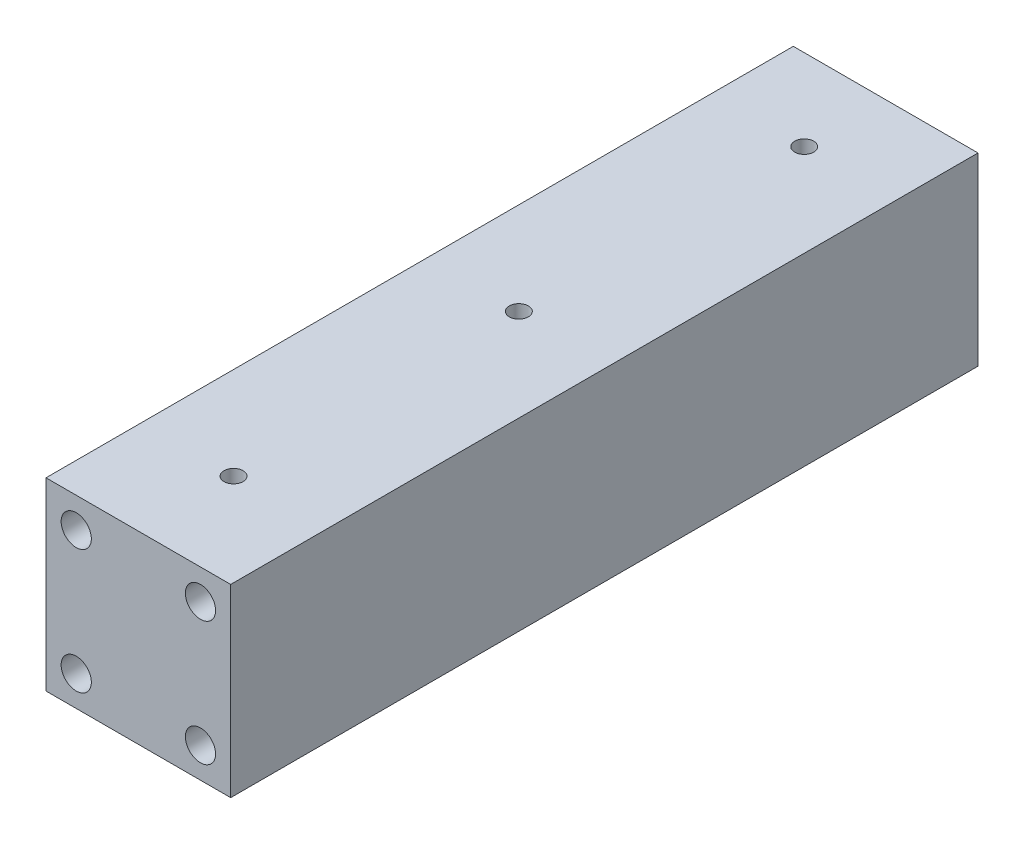
ISO-10303-21;
HEADER;
FILE_DESCRIPTION(('STEP AP214'),'2;1');
FILE_NAME('part.step','',(''),(''),'','','');
FILE_SCHEMA(('AUTOMOTIVE_DESIGN { 1 0 10303 214 1 1 1 1 }'));
ENDSEC;
DATA;
#1=APPLICATION_CONTEXT('core data for automotive mechanical design processes');
#2=APPLICATION_PROTOCOL_DEFINITION('international standard','automotive_design',2000,#1);
#3=PRODUCT_CONTEXT('',#1,'mechanical');
#4=PRODUCT('Part','Part','',(#3));
#5=PRODUCT_RELATED_PRODUCT_CATEGORY('part','',(#4));
#6=PRODUCT_DEFINITION_FORMATION('','',#4);
#7=PRODUCT_DEFINITION_CONTEXT('part definition',#1,'design');
#8=PRODUCT_DEFINITION('design','',#6,#7);
#9=PRODUCT_DEFINITION_SHAPE('','',#8);
#10=(LENGTH_UNIT() NAMED_UNIT(*) SI_UNIT(.MILLI.,.METRE.));
#11=(NAMED_UNIT(*) PLANE_ANGLE_UNIT() SI_UNIT($,.RADIAN.));
#12=(NAMED_UNIT(*) SI_UNIT($,.STERADIAN.) SOLID_ANGLE_UNIT());
#13=UNCERTAINTY_MEASURE_WITH_UNIT(LENGTH_MEASURE(1.E-05),#10,'distance_accuracy_value','');
#14=(GEOMETRIC_REPRESENTATION_CONTEXT(3) GLOBAL_UNCERTAINTY_ASSIGNED_CONTEXT((#13)) GLOBAL_UNIT_ASSIGNED_CONTEXT((#10,
#11,#12)) REPRESENTATION_CONTEXT('',''));
#15=CARTESIAN_POINT('',(0.,0.,0.));
#16=DIRECTION('',(0.,0.,1.));
#17=DIRECTION('',(1.,0.,0.));
#18=AXIS2_PLACEMENT_3D('',#15,#16,#17);
#19=CARTESIAN_POINT('',(0.,38.80104,0.));
#20=DIRECTION('',(0.,0.,-1.));
#21=DIRECTION('',(-1.,0.,0.));
#22=AXIS2_PLACEMENT_3D('',#19,#20,#21);
#23=PLANE('',#22);
#24=CARTESIAN_POINT('',(-6.55051999999914,6.35000000000094,0.));
#25=DIRECTION('',(0.,0.,1.));
#26=DIRECTION('',(1.,0.,0.));
#27=AXIS2_PLACEMENT_3D('',#24,#25,#26);
#28=CIRCLE('',#27,3.17499999999884);
#29=CARTESIAN_POINT('',(-3.37552000000031,6.35000000000094,0.));
#30=VERTEX_POINT('',#29);
#31=EDGE_CURVE('E137',#30,#30,#28,.T.);
#32=ORIENTED_EDGE('',*,*,#31,.F.);
#33=EDGE_LOOP('',(#32));
#34=FACE_BOUND('',#33,.T.);
#35=CARTESIAN_POINT('',(19.5505199999996,6.35000000000095,0.));
#36=DIRECTION('',(0.,0.,1.));
#37=DIRECTION('',(1.,0.,0.));
#38=AXIS2_PLACEMENT_3D('',#35,#36,#37);
#39=CIRCLE('',#38,3.17500000000024);
#40=CARTESIAN_POINT('',(22.7255199999999,6.35000000000095,0.));
#41=VERTEX_POINT('',#40);
#42=EDGE_CURVE('E141',#41,#41,#39,.T.);
#43=ORIENTED_EDGE('',*,*,#42,.F.);
#44=EDGE_LOOP('',(#43));
#45=FACE_BOUND('',#44,.T.);
#46=CARTESIAN_POINT('',(19.5505199999996,32.4510400000001,0.));
#47=DIRECTION('',(0.,0.,1.));
#48=DIRECTION('',(1.,0.,0.));
#49=AXIS2_PLACEMENT_3D('',#46,#47,#48);
#50=CIRCLE('',#49,3.17500000000054);
#51=CARTESIAN_POINT('',(22.7255200000002,32.4510400000001,0.));
#52=VERTEX_POINT('',#51);
#53=EDGE_CURVE('E145',#52,#52,#50,.T.);
#54=ORIENTED_EDGE('',*,*,#53,.F.);
#55=EDGE_LOOP('',(#54));
#56=FACE_BOUND('',#55,.T.);
#57=CARTESIAN_POINT('',(-6.55051999999998,32.4510400000001,0.));
#58=DIRECTION('',(0.,0.,1.));
#59=DIRECTION('',(1.,0.,0.));
#60=AXIS2_PLACEMENT_3D('',#57,#58,#59);
#61=CIRCLE('',#60,3.175);
#62=CARTESIAN_POINT('',(-3.37551999999998,32.4510400000001,0.));
#63=VERTEX_POINT('',#62);
#64=EDGE_CURVE('E148',#63,#63,#61,.T.);
#65=ORIENTED_EDGE('',*,*,#64,.F.);
#66=EDGE_LOOP('',(#65));
#67=FACE_BOUND('',#66,.T.);
#68=DIRECTION('',(1.,0.,0.));
#69=VECTOR('',#68,1.);
#70=CARTESIAN_POINT('',(0.,0.,0.));
#71=LINE('',#70,#69);
#72=CARTESIAN_POINT('',(-12.90052,0.,0.));
#73=VERTEX_POINT('',#72);
#74=CARTESIAN_POINT('',(25.9005200000001,0.,0.));
#75=VERTEX_POINT('',#74);
#76=EDGE_CURVE('E102',#73,#75,#71,.T.);
#77=ORIENTED_EDGE('',*,*,#76,.T.);
#78=DIRECTION('',(0.,-1.,0.));
#79=VECTOR('',#78,1.);
#80=CARTESIAN_POINT('',(25.9005200000001,38.80104,0.));
#81=LINE('',#80,#79);
#82=CARTESIAN_POINT('',(25.9005200000001,38.80104,0.));
#83=VERTEX_POINT('',#82);
#84=EDGE_CURVE('E11',#83,#75,#81,.T.);
#85=ORIENTED_EDGE('',*,*,#84,.F.);
#86=DIRECTION('',(1.,0.,0.));
#87=VECTOR('',#86,1.);
#88=CARTESIAN_POINT('',(0.,38.80104,0.));
#89=LINE('',#88,#87);
#90=CARTESIAN_POINT('',(-12.90052,38.80104,0.));
#91=VERTEX_POINT('',#90);
#92=EDGE_CURVE('E87',#91,#83,#89,.T.);
#93=ORIENTED_EDGE('',*,*,#92,.F.);
#94=DIRECTION('',(0.,-1.,0.));
#95=VECTOR('',#94,1.);
#96=CARTESIAN_POINT('',(-12.90052,38.80104,0.));
#97=LINE('',#96,#95);
#98=EDGE_CURVE('E98',#91,#73,#97,.T.);
#99=ORIENTED_EDGE('',*,*,#98,.T.);
#100=EDGE_LOOP('',(#77,#85,#93,#99));
#101=FACE_BOUND('',#100,.T.);
#102=ADVANCED_FACE('F40',(#34,#45,#56,#67,#101),#23,.F.);
#103=CARTESIAN_POINT('',(25.9005200000001,38.80104,0.));
#104=DIRECTION('',(-1.,0.,0.));
#105=DIRECTION('',(0.,0.,1.));
#106=AXIS2_PLACEMENT_3D('',#103,#104,#105);
#107=PLANE('',#106);
#108=DIRECTION('',(0.,0.,-1.));
#109=VECTOR('',#108,1.);
#110=CARTESIAN_POINT('',(25.9005200000001,0.,0.));
#111=LINE('',#110,#109);
#112=CARTESIAN_POINT('',(25.90052,0.,-156.99994));
#113=VERTEX_POINT('',#112);
#114=EDGE_CURVE('E92',#75,#113,#111,.T.);
#115=ORIENTED_EDGE('',*,*,#114,.T.);
#116=DIRECTION('',(0.,-1.,0.));
#117=VECTOR('',#116,1.);
#118=CARTESIAN_POINT('',(25.90052,38.80104,-156.99994));
#119=LINE('',#118,#117);
#120=CARTESIAN_POINT('',(25.90052,38.80104,-156.99994));
#121=VERTEX_POINT('',#120);
#122=EDGE_CURVE('E48',#121,#113,#119,.T.);
#123=ORIENTED_EDGE('',*,*,#122,.F.);
#124=DIRECTION('',(0.,0.,-1.));
#125=VECTOR('',#124,1.);
#126=CARTESIAN_POINT('',(25.9005200000001,38.80104,0.));
#127=LINE('',#126,#125);
#128=EDGE_CURVE('E82',#83,#121,#127,.T.);
#129=ORIENTED_EDGE('',*,*,#128,.F.);
#130=ORIENTED_EDGE('',*,*,#84,.T.);
#131=EDGE_LOOP('',(#115,#123,#129,#130));
#132=FACE_BOUND('',#131,.T.);
#133=ADVANCED_FACE('F91',(#132),#107,.F.);
#134=CARTESIAN_POINT('',(-1.12306879050644E-13,38.80104,-156.99994));
#135=DIRECTION('',(0.,0.,-1.));
#136=DIRECTION('',(-1.,0.,0.));
#137=AXIS2_PLACEMENT_3D('',#134,#135,#136);
#138=PLANE('',#137);
#139=CARTESIAN_POINT('',(-6.55051999999914,6.35000000000094,-156.99994));
#140=DIRECTION('',(0.,0.,-1.));
#141=DIRECTION('',(-1.,0.,0.));
#142=AXIS2_PLACEMENT_3D('',#139,#140,#141);
#143=CIRCLE('',#142,3.17499999999884);
#144=CARTESIAN_POINT('',(-9.72551999999798,6.35000000000094,-156.99994));
#145=VERTEX_POINT('',#144);
#146=EDGE_CURVE('E287',#145,#145,#143,.T.);
#147=ORIENTED_EDGE('',*,*,#146,.F.);
#148=EDGE_LOOP('',(#147));
#149=FACE_BOUND('',#148,.T.);
#150=CARTESIAN_POINT('',(19.5505199999996,6.35000000000095,-156.99994));
#151=DIRECTION('',(0.,0.,-1.));
#152=DIRECTION('',(-1.,0.,0.));
#153=AXIS2_PLACEMENT_3D('',#150,#151,#152);
#154=CIRCLE('',#153,3.17500000000024);
#155=CARTESIAN_POINT('',(16.3755199999994,6.35000000000095,-156.99994));
#156=VERTEX_POINT('',#155);
#157=EDGE_CURVE('E281',#156,#156,#154,.T.);
#158=ORIENTED_EDGE('',*,*,#157,.F.);
#159=EDGE_LOOP('',(#158));
#160=FACE_BOUND('',#159,.T.);
#161=CARTESIAN_POINT('',(19.5505199999996,32.4510400000001,-156.99994));
#162=DIRECTION('',(0.,0.,-1.));
#163=DIRECTION('',(-1.,0.,0.));
#164=AXIS2_PLACEMENT_3D('',#161,#162,#163);
#165=CIRCLE('',#164,3.17500000000054);
#166=CARTESIAN_POINT('',(16.3755199999991,32.4510400000001,-156.99994));
#167=VERTEX_POINT('',#166);
#168=EDGE_CURVE('E270',#167,#167,#165,.T.);
#169=ORIENTED_EDGE('',*,*,#168,.F.);
#170=EDGE_LOOP('',(#169));
#171=FACE_BOUND('',#170,.T.);
#172=CARTESIAN_POINT('',(-6.55051999999998,32.4510400000001,-156.99994));
#173=DIRECTION('',(0.,0.,-1.));
#174=DIRECTION('',(-1.,0.,0.));
#175=AXIS2_PLACEMENT_3D('',#172,#173,#174);
#176=CIRCLE('',#175,3.175);
#177=CARTESIAN_POINT('',(-9.72551999999997,32.4510400000001,-156.99994));
#178=VERTEX_POINT('',#177);
#179=EDGE_CURVE('E269',#178,#178,#176,.T.);
#180=ORIENTED_EDGE('',*,*,#179,.F.);
#181=EDGE_LOOP('',(#180));
#182=FACE_BOUND('',#181,.T.);
#183=DIRECTION('',(1.,0.,0.));
#184=VECTOR('',#183,1.);
#185=CARTESIAN_POINT('',(-1.12306879050644E-13,0.,-156.99994));
#186=LINE('',#185,#184);
#187=CARTESIAN_POINT('',(-12.90052,0.,-156.99994));
#188=VERTEX_POINT('',#187);
#189=EDGE_CURVE('E107',#188,#113,#186,.T.);
#190=ORIENTED_EDGE('',*,*,#189,.F.);
#191=DIRECTION('',(0.,-1.,0.));
#192=VECTOR('',#191,1.);
#193=CARTESIAN_POINT('',(-12.90052,38.80104,-156.99994));
#194=LINE('',#193,#192);
#195=CARTESIAN_POINT('',(-12.90052,38.80104,-156.99994));
#196=VERTEX_POINT('',#195);
#197=EDGE_CURVE('E72',#196,#188,#194,.T.);
#198=ORIENTED_EDGE('',*,*,#197,.F.);
#199=DIRECTION('',(1.,0.,0.));
#200=VECTOR('',#199,1.);
#201=CARTESIAN_POINT('',(-1.12306879050644E-13,38.80104,-156.99994));
#202=LINE('',#201,#200);
#203=EDGE_CURVE('E85',#196,#121,#202,.T.);
#204=ORIENTED_EDGE('',*,*,#203,.T.);
#205=ORIENTED_EDGE('',*,*,#122,.T.);
#206=EDGE_LOOP('',(#190,#198,#204,#205));
#207=FACE_BOUND('',#206,.T.);
#208=ADVANCED_FACE('F96',(#149,#160,#171,#182,#207),#138,.T.);
#209=CARTESIAN_POINT('',(-12.90052,38.80104,0.));
#210=DIRECTION('',(1.,0.,0.));
#211=DIRECTION('',(0.,0.,-1.));
#212=AXIS2_PLACEMENT_3D('',#209,#210,#211);
#213=PLANE('',#212);
#214=DIRECTION('',(0.,0.,1.));
#215=VECTOR('',#214,1.);
#216=CARTESIAN_POINT('',(-12.90052,0.,0.));
#217=LINE('',#216,#215);
#218=EDGE_CURVE('E75',#188,#73,#217,.T.);
#219=ORIENTED_EDGE('',*,*,#218,.T.);
#220=ORIENTED_EDGE('',*,*,#98,.F.);
#221=DIRECTION('',(0.,0.,1.));
#222=VECTOR('',#221,1.);
#223=CARTESIAN_POINT('',(-12.90052,38.80104,0.));
#224=LINE('',#223,#222);
#225=EDGE_CURVE('E56',#196,#91,#224,.T.);
#226=ORIENTED_EDGE('',*,*,#225,.F.);
#227=ORIENTED_EDGE('',*,*,#197,.T.);
#228=EDGE_LOOP('',(#219,#220,#226,#227));
#229=FACE_BOUND('',#228,.T.);
#230=ADVANCED_FACE('F125',(#229),#213,.F.);
#231=CARTESIAN_POINT('',(0.,38.80104,0.));
#232=DIRECTION('',(0.,1.,0.));
#233=DIRECTION('',(0.,0.,1.));
#234=AXIS2_PLACEMENT_3D('',#231,#232,#233);
#235=PLANE('',#234);
#236=CARTESIAN_POINT('',(6.5,38.80104,-20.));
#237=DIRECTION('',(0.,1.,0.));
#238=DIRECTION('',(0.,0.,1.));
#239=AXIS2_PLACEMENT_3D('',#236,#237,#238);
#240=CIRCLE('',#239,2.);
#241=CARTESIAN_POINT('',(6.5,38.80104,-18.));
#242=VERTEX_POINT('',#241);
#243=EDGE_CURVE('E162',#242,#242,#240,.T.);
#244=ORIENTED_EDGE('',*,*,#243,.F.);
#245=EDGE_LOOP('',(#244));
#246=FACE_BOUND('',#245,.T.);
#247=CARTESIAN_POINT('',(6.5,38.80104,-79.944));
#248=DIRECTION('',(0.,1.,0.));
#249=DIRECTION('',(0.,0.,1.));
#250=AXIS2_PLACEMENT_3D('',#247,#248,#249);
#251=CIRCLE('',#250,2.);
#252=CARTESIAN_POINT('',(6.5,38.80104,-77.944));
#253=VERTEX_POINT('',#252);
#254=EDGE_CURVE('E168',#253,#253,#251,.T.);
#255=ORIENTED_EDGE('',*,*,#254,.F.);
#256=EDGE_LOOP('',(#255));
#257=FACE_BOUND('',#256,.T.);
#258=CARTESIAN_POINT('',(6.5,38.80104,-139.888));
#259=DIRECTION('',(0.,1.,0.));
#260=DIRECTION('',(0.,0.,1.));
#261=AXIS2_PLACEMENT_3D('',#258,#259,#260);
#262=CIRCLE('',#261,2.);
#263=CARTESIAN_POINT('',(6.5,38.80104,-137.888));
#264=VERTEX_POINT('',#263);
#265=EDGE_CURVE('E154',#264,#264,#262,.T.);
#266=ORIENTED_EDGE('',*,*,#265,.F.);
#267=EDGE_LOOP('',(#266));
#268=FACE_BOUND('',#267,.T.);
#269=ORIENTED_EDGE('',*,*,#92,.T.);
#270=ORIENTED_EDGE('',*,*,#128,.T.);
#271=ORIENTED_EDGE('',*,*,#203,.F.);
#272=ORIENTED_EDGE('',*,*,#225,.T.);
#273=EDGE_LOOP('',(#269,#270,#271,#272));
#274=FACE_BOUND('',#273,.T.);
#275=ADVANCED_FACE('F83',(#246,#257,#268,#274),#235,.T.);
#276=CARTESIAN_POINT('',(0.,0.,0.));
#277=DIRECTION('',(0.,1.,0.));
#278=DIRECTION('',(0.,0.,1.));
#279=AXIS2_PLACEMENT_3D('',#276,#277,#278);
#280=PLANE('',#279);
#281=ORIENTED_EDGE('',*,*,#76,.F.);
#282=ORIENTED_EDGE('',*,*,#218,.F.);
#283=ORIENTED_EDGE('',*,*,#189,.T.);
#284=ORIENTED_EDGE('',*,*,#114,.F.);
#285=EDGE_LOOP('',(#281,#282,#283,#284));
#286=FACE_BOUND('',#285,.T.);
#287=ADVANCED_FACE('F114',(#286),#280,.F.);
#288=CARTESIAN_POINT('',(6.5,32.45104,-139.888));
#289=DIRECTION('',(0.,1.,0.));
#290=DIRECTION('',(0.,0.,1.));
#291=AXIS2_PLACEMENT_3D('',#288,#289,#290);
#292=CYLINDRICAL_SURFACE('',#291,2.);
#293=CARTESIAN_POINT('',(6.5,32.45104,-139.888));
#294=DIRECTION('',(0.,1.,0.));
#295=DIRECTION('',(0.,0.,1.));
#296=AXIS2_PLACEMENT_3D('',#293,#294,#295);
#297=CIRCLE('',#296,2.);
#298=CARTESIAN_POINT('',(6.5,32.45104,-137.888));
#299=VERTEX_POINT('',#298);
#300=EDGE_CURVE('E171',#299,#299,#297,.T.);
#301=ORIENTED_EDGE('',*,*,#300,.F.);
#302=EDGE_LOOP('',(#301));
#303=FACE_BOUND('',#302,.T.);
#304=ORIENTED_EDGE('',*,*,#265,.T.);
#305=EDGE_LOOP('',(#304));
#306=FACE_BOUND('',#305,.T.);
#307=ADVANCED_FACE('F116',(#303,#306),#292,.F.);
#308=CARTESIAN_POINT('',(6.5,32.45104,-139.888));
#309=DIRECTION('',(0.,1.,0.));
#310=DIRECTION('',(0.,0.,1.));
#311=AXIS2_PLACEMENT_3D('',#308,#309,#310);
#312=PLANE('',#311);
#313=ORIENTED_EDGE('',*,*,#300,.T.);
#314=EDGE_LOOP('',(#313));
#315=FACE_BOUND('',#314,.T.);
#316=ADVANCED_FACE('F122',(#315),#312,.T.);
#317=CARTESIAN_POINT('',(6.5,32.45104,-79.944));
#318=DIRECTION('',(0.,1.,0.));
#319=DIRECTION('',(0.,0.,1.));
#320=AXIS2_PLACEMENT_3D('',#317,#318,#319);
#321=CYLINDRICAL_SURFACE('',#320,2.);
#322=CARTESIAN_POINT('',(6.5,32.45104,-79.944));
#323=DIRECTION('',(0.,1.,0.));
#324=DIRECTION('',(0.,0.,1.));
#325=AXIS2_PLACEMENT_3D('',#322,#323,#324);
#326=CIRCLE('',#325,2.);
#327=CARTESIAN_POINT('',(6.5,32.45104,-77.944));
#328=VERTEX_POINT('',#327);
#329=EDGE_CURVE('E165',#328,#328,#326,.T.);
#330=ORIENTED_EDGE('',*,*,#329,.F.);
#331=EDGE_LOOP('',(#330));
#332=FACE_BOUND('',#331,.T.);
#333=ORIENTED_EDGE('',*,*,#254,.T.);
#334=EDGE_LOOP('',(#333));
#335=FACE_BOUND('',#334,.T.);
#336=ADVANCED_FACE('F181',(#332,#335),#321,.F.);
#337=CARTESIAN_POINT('',(6.5,32.45104,-79.944));
#338=DIRECTION('',(0.,1.,0.));
#339=DIRECTION('',(0.,0.,1.));
#340=AXIS2_PLACEMENT_3D('',#337,#338,#339);
#341=PLANE('',#340);
#342=ORIENTED_EDGE('',*,*,#329,.T.);
#343=EDGE_LOOP('',(#342));
#344=FACE_BOUND('',#343,.T.);
#345=ADVANCED_FACE('F186',(#344),#341,.T.);
#346=CARTESIAN_POINT('',(6.5,32.45104,-20.));
#347=DIRECTION('',(0.,1.,0.));
#348=DIRECTION('',(0.,0.,1.));
#349=AXIS2_PLACEMENT_3D('',#346,#347,#348);
#350=CYLINDRICAL_SURFACE('',#349,2.);
#351=CARTESIAN_POINT('',(6.5,32.45104,-20.));
#352=DIRECTION('',(0.,1.,0.));
#353=DIRECTION('',(0.,0.,1.));
#354=AXIS2_PLACEMENT_3D('',#351,#352,#353);
#355=CIRCLE('',#354,2.);
#356=CARTESIAN_POINT('',(6.5,32.45104,-18.));
#357=VERTEX_POINT('',#356);
#358=EDGE_CURVE('E105',#357,#357,#355,.T.);
#359=ORIENTED_EDGE('',*,*,#358,.F.);
#360=EDGE_LOOP('',(#359));
#361=FACE_BOUND('',#360,.T.);
#362=ORIENTED_EDGE('',*,*,#243,.T.);
#363=EDGE_LOOP('',(#362));
#364=FACE_BOUND('',#363,.T.);
#365=ADVANCED_FACE('F192',(#361,#364),#350,.F.);
#366=CARTESIAN_POINT('',(6.5,32.45104,-20.));
#367=DIRECTION('',(0.,1.,0.));
#368=DIRECTION('',(0.,0.,1.));
#369=AXIS2_PLACEMENT_3D('',#366,#367,#368);
#370=PLANE('',#369);
#371=ORIENTED_EDGE('',*,*,#358,.T.);
#372=EDGE_LOOP('',(#371));
#373=FACE_BOUND('',#372,.T.);
#374=ADVANCED_FACE('F196',(#373),#370,.T.);
#375=CARTESIAN_POINT('',(-6.55051999999998,32.4510400000001,-12.7));
#376=DIRECTION('',(0.,0.,1.));
#377=DIRECTION('',(1.,0.,0.));
#378=AXIS2_PLACEMENT_3D('',#375,#376,#377);
#379=CYLINDRICAL_SURFACE('',#378,3.175);
#380=CARTESIAN_POINT('',(-6.55051999999998,32.4510400000001,-12.7));
#381=DIRECTION('',(0.,0.,1.));
#382=DIRECTION('',(1.,0.,0.));
#383=AXIS2_PLACEMENT_3D('',#380,#381,#382);
#384=CIRCLE('',#383,3.175);
#385=CARTESIAN_POINT('',(-3.37551999999998,32.4510400000001,-12.7));
#386=VERTEX_POINT('',#385);
#387=EDGE_CURVE('E150',#386,#386,#384,.T.);
#388=ORIENTED_EDGE('',*,*,#387,.F.);
#389=EDGE_LOOP('',(#388));
#390=FACE_BOUND('',#389,.T.);
#391=ORIENTED_EDGE('',*,*,#64,.T.);
#392=EDGE_LOOP('',(#391));
#393=FACE_BOUND('',#392,.T.);
#394=ADVANCED_FACE('F200',(#390,#393),#379,.F.);
#395=CARTESIAN_POINT('',(0.,0.,-12.7));
#396=DIRECTION('',(0.,0.,1.));
#397=DIRECTION('',(1.,0.,0.));
#398=AXIS2_PLACEMENT_3D('',#395,#396,#397);
#399=PLANE('',#398);
#400=ORIENTED_EDGE('',*,*,#387,.T.);
#401=EDGE_LOOP('',(#400));
#402=FACE_BOUND('',#401,.T.);
#403=ADVANCED_FACE('F204',(#402),#399,.T.);
#404=CARTESIAN_POINT('',(19.5505199999996,32.4510400000001,-12.7));
#405=DIRECTION('',(0.,0.,1.));
#406=DIRECTION('',(1.,0.,0.));
#407=AXIS2_PLACEMENT_3D('',#404,#405,#406);
#408=CYLINDRICAL_SURFACE('',#407,3.17500000000054);
#409=CARTESIAN_POINT('',(19.5505199999996,32.4510400000001,-12.7));
#410=DIRECTION('',(0.,0.,1.));
#411=DIRECTION('',(1.,0.,0.));
#412=AXIS2_PLACEMENT_3D('',#409,#410,#411);
#413=CIRCLE('',#412,3.17500000000054);
#414=CARTESIAN_POINT('',(22.7255200000002,32.4510400000001,-12.7));
#415=VERTEX_POINT('',#414);
#416=EDGE_CURVE('E151',#415,#415,#413,.T.);
#417=ORIENTED_EDGE('',*,*,#416,.F.);
#418=EDGE_LOOP('',(#417));
#419=FACE_BOUND('',#418,.T.);
#420=ORIENTED_EDGE('',*,*,#53,.T.);
#421=EDGE_LOOP('',(#420));
#422=FACE_BOUND('',#421,.T.);
#423=ADVANCED_FACE('F208',(#419,#422),#408,.F.);
#424=CARTESIAN_POINT('',(0.,0.,-12.7));
#425=DIRECTION('',(0.,0.,1.));
#426=DIRECTION('',(1.,0.,0.));
#427=AXIS2_PLACEMENT_3D('',#424,#425,#426);
#428=PLANE('',#427);
#429=ORIENTED_EDGE('',*,*,#416,.T.);
#430=EDGE_LOOP('',(#429));
#431=FACE_BOUND('',#430,.T.);
#432=ADVANCED_FACE('F223',(#431),#428,.T.);
#433=CARTESIAN_POINT('',(19.5505199999996,6.35000000000095,-12.7));
#434=DIRECTION('',(0.,0.,1.));
#435=DIRECTION('',(1.,0.,0.));
#436=AXIS2_PLACEMENT_3D('',#433,#434,#435);
#437=CYLINDRICAL_SURFACE('',#436,3.17500000000024);
#438=CARTESIAN_POINT('',(19.5505199999996,6.35000000000095,-12.7));
#439=DIRECTION('',(0.,0.,1.));
#440=DIRECTION('',(1.,0.,0.));
#441=AXIS2_PLACEMENT_3D('',#438,#439,#440);
#442=CIRCLE('',#441,3.17500000000024);
#443=CARTESIAN_POINT('',(22.7255199999999,6.35000000000095,-12.7));
#444=VERTEX_POINT('',#443);
#445=EDGE_CURVE('E293',#444,#444,#442,.T.);
#446=ORIENTED_EDGE('',*,*,#445,.F.);
#447=EDGE_LOOP('',(#446));
#448=FACE_BOUND('',#447,.T.);
#449=ORIENTED_EDGE('',*,*,#42,.T.);
#450=EDGE_LOOP('',(#449));
#451=FACE_BOUND('',#450,.T.);
#452=ADVANCED_FACE('F220',(#448,#451),#437,.F.);
#453=CARTESIAN_POINT('',(0.,0.,-12.7));
#454=DIRECTION('',(0.,0.,1.));
#455=DIRECTION('',(1.,0.,0.));
#456=AXIS2_PLACEMENT_3D('',#453,#454,#455);
#457=PLANE('',#456);
#458=ORIENTED_EDGE('',*,*,#445,.T.);
#459=EDGE_LOOP('',(#458));
#460=FACE_BOUND('',#459,.T.);
#461=ADVANCED_FACE('F214',(#460),#457,.T.);
#462=CARTESIAN_POINT('',(-6.55051999999914,6.35000000000094,-12.7));
#463=DIRECTION('',(0.,0.,1.));
#464=DIRECTION('',(1.,0.,0.));
#465=AXIS2_PLACEMENT_3D('',#462,#463,#464);
#466=CYLINDRICAL_SURFACE('',#465,3.17499999999884);
#467=CARTESIAN_POINT('',(-6.55051999999914,6.35000000000094,-12.7));
#468=DIRECTION('',(0.,0.,1.));
#469=DIRECTION('',(1.,0.,0.));
#470=AXIS2_PLACEMENT_3D('',#467,#468,#469);
#471=CIRCLE('',#470,3.17499999999884);
#472=CARTESIAN_POINT('',(-3.37552000000031,6.35000000000094,-12.7));
#473=VERTEX_POINT('',#472);
#474=EDGE_CURVE('E297',#473,#473,#471,.T.);
#475=ORIENTED_EDGE('',*,*,#474,.F.);
#476=EDGE_LOOP('',(#475));
#477=FACE_BOUND('',#476,.T.);
#478=ORIENTED_EDGE('',*,*,#31,.T.);
#479=EDGE_LOOP('',(#478));
#480=FACE_BOUND('',#479,.T.);
#481=ADVANCED_FACE('F210',(#477,#480),#466,.F.);
#482=CARTESIAN_POINT('',(0.,0.,-12.7));
#483=DIRECTION('',(0.,0.,1.));
#484=DIRECTION('',(1.,0.,0.));
#485=AXIS2_PLACEMENT_3D('',#482,#483,#484);
#486=PLANE('',#485);
#487=ORIENTED_EDGE('',*,*,#474,.T.);
#488=EDGE_LOOP('',(#487));
#489=FACE_BOUND('',#488,.T.);
#490=ADVANCED_FACE('F213',(#489),#486,.T.);
#491=CARTESIAN_POINT('',(-6.55051999999998,32.4510400000001,-144.29994));
#492=DIRECTION('',(0.,0.,-1.));
#493=DIRECTION('',(-1.,0.,0.));
#494=AXIS2_PLACEMENT_3D('',#491,#492,#493);
#495=CYLINDRICAL_SURFACE('',#494,3.175);
#496=CARTESIAN_POINT('',(-6.55051999999998,32.4510400000001,-144.29994));
#497=DIRECTION('',(0.,0.,-1.));
#498=DIRECTION('',(-1.,0.,0.));
#499=AXIS2_PLACEMENT_3D('',#496,#497,#498);
#500=CIRCLE('',#499,3.175);
#501=CARTESIAN_POINT('',(-9.72551999999997,32.4510400000001,-144.29994));
#502=VERTEX_POINT('',#501);
#503=EDGE_CURVE('E273',#502,#502,#500,.T.);
#504=ORIENTED_EDGE('',*,*,#503,.F.);
#505=EDGE_LOOP('',(#504));
#506=FACE_BOUND('',#505,.T.);
#507=ORIENTED_EDGE('',*,*,#179,.T.);
#508=EDGE_LOOP('',(#507));
#509=FACE_BOUND('',#508,.T.);
#510=ADVANCED_FACE('F218',(#506,#509),#495,.F.);
#511=CARTESIAN_POINT('',(-6.55051999999998,32.4510400000001,-144.29994));
#512=DIRECTION('',(0.,0.,-1.));
#513=DIRECTION('',(-1.,0.,0.));
#514=AXIS2_PLACEMENT_3D('',#511,#512,#513);
#515=PLANE('',#514);
#516=ORIENTED_EDGE('',*,*,#503,.T.);
#517=EDGE_LOOP('',(#516));
#518=FACE_BOUND('',#517,.T.);
#519=ADVANCED_FACE('F236',(#518),#515,.T.);
#520=CARTESIAN_POINT('',(19.5505199999996,32.4510400000001,-144.29994));
#521=DIRECTION('',(0.,0.,-1.));
#522=DIRECTION('',(-1.,0.,0.));
#523=AXIS2_PLACEMENT_3D('',#520,#521,#522);
#524=CYLINDRICAL_SURFACE('',#523,3.17500000000054);
#525=CARTESIAN_POINT('',(19.5505199999996,32.4510400000001,-144.29994));
#526=DIRECTION('',(0.,0.,-1.));
#527=DIRECTION('',(-1.,0.,0.));
#528=AXIS2_PLACEMENT_3D('',#525,#526,#527);
#529=CIRCLE('',#528,3.17500000000054);
#530=CARTESIAN_POINT('',(16.3755199999991,32.4510400000001,-144.29994));
#531=VERTEX_POINT('',#530);
#532=EDGE_CURVE('E268',#531,#531,#529,.T.);
#533=ORIENTED_EDGE('',*,*,#532,.F.);
#534=EDGE_LOOP('',(#533));
#535=FACE_BOUND('',#534,.T.);
#536=ORIENTED_EDGE('',*,*,#168,.T.);
#537=EDGE_LOOP('',(#536));
#538=FACE_BOUND('',#537,.T.);
#539=ADVANCED_FACE('F240',(#535,#538),#524,.F.);
#540=CARTESIAN_POINT('',(19.5505199999996,32.4510400000001,-144.29994));
#541=DIRECTION('',(0.,0.,-1.));
#542=DIRECTION('',(-1.,0.,0.));
#543=AXIS2_PLACEMENT_3D('',#540,#541,#542);
#544=PLANE('',#543);
#545=ORIENTED_EDGE('',*,*,#532,.T.);
#546=EDGE_LOOP('',(#545));
#547=FACE_BOUND('',#546,.T.);
#548=ADVANCED_FACE('F254',(#547),#544,.T.);
#549=CARTESIAN_POINT('',(19.5505199999996,6.35000000000095,-144.29994));
#550=DIRECTION('',(0.,0.,-1.));
#551=DIRECTION('',(-1.,0.,0.));
#552=AXIS2_PLACEMENT_3D('',#549,#550,#551);
#553=CYLINDRICAL_SURFACE('',#552,3.17500000000024);
#554=CARTESIAN_POINT('',(19.5505199999996,6.35000000000095,-144.29994));
#555=DIRECTION('',(0.,0.,-1.));
#556=DIRECTION('',(-1.,0.,0.));
#557=AXIS2_PLACEMENT_3D('',#554,#555,#556);
#558=CIRCLE('',#557,3.17500000000024);
#559=CARTESIAN_POINT('',(16.3755199999994,6.35000000000095,-144.29994));
#560=VERTEX_POINT('',#559);
#561=EDGE_CURVE('E276',#560,#560,#558,.T.);
#562=ORIENTED_EDGE('',*,*,#561,.F.);
#563=EDGE_LOOP('',(#562));
#564=FACE_BOUND('',#563,.T.);
#565=ORIENTED_EDGE('',*,*,#157,.T.);
#566=EDGE_LOOP('',(#565));
#567=FACE_BOUND('',#566,.T.);
#568=ADVANCED_FACE('F251',(#564,#567),#553,.F.);
#569=CARTESIAN_POINT('',(19.5505199999996,6.35000000000095,-144.29994));
#570=DIRECTION('',(0.,0.,-1.));
#571=DIRECTION('',(-1.,0.,0.));
#572=AXIS2_PLACEMENT_3D('',#569,#570,#571);
#573=PLANE('',#572);
#574=ORIENTED_EDGE('',*,*,#561,.T.);
#575=EDGE_LOOP('',(#574));
#576=FACE_BOUND('',#575,.T.);
#577=ADVANCED_FACE('F246',(#576),#573,.T.);
#578=CARTESIAN_POINT('',(-6.55051999999914,6.35000000000094,-144.29994));
#579=DIRECTION('',(0.,0.,-1.));
#580=DIRECTION('',(-1.,0.,0.));
#581=AXIS2_PLACEMENT_3D('',#578,#579,#580);
#582=CYLINDRICAL_SURFACE('',#581,3.17499999999884);
#583=CARTESIAN_POINT('',(-6.55051999999914,6.35000000000094,-144.29994));
#584=DIRECTION('',(0.,0.,-1.));
#585=DIRECTION('',(-1.,0.,0.));
#586=AXIS2_PLACEMENT_3D('',#583,#584,#585);
#587=CIRCLE('',#586,3.17499999999884);
#588=CARTESIAN_POINT('',(-9.72551999999798,6.35000000000094,-144.29994));
#589=VERTEX_POINT('',#588);
#590=EDGE_CURVE('E284',#589,#589,#587,.T.);
#591=ORIENTED_EDGE('',*,*,#590,.F.);
#592=EDGE_LOOP('',(#591));
#593=FACE_BOUND('',#592,.T.);
#594=ORIENTED_EDGE('',*,*,#146,.T.);
#595=EDGE_LOOP('',(#594));
#596=FACE_BOUND('',#595,.T.);
#597=ADVANCED_FACE('F242',(#593,#596),#582,.F.);
#598=CARTESIAN_POINT('',(-6.55051999999914,6.35000000000094,-144.29994));
#599=DIRECTION('',(0.,0.,-1.));
#600=DIRECTION('',(-1.,0.,0.));
#601=AXIS2_PLACEMENT_3D('',#598,#599,#600);
#602=PLANE('',#601);
#603=ORIENTED_EDGE('',*,*,#590,.T.);
#604=EDGE_LOOP('',(#603));
#605=FACE_BOUND('',#604,.T.);
#606=ADVANCED_FACE('F245',(#605),#602,.T.);
#607=CLOSED_SHELL('',(#102,#133,#208,#230,#275,#287,#307,#316,#336,#345,#365,#374,#394,#403,
#423,#432,#452,#461,#481,#490,#510,#519,#539,#548,#568,#577,#597,#606));
#608=MANIFOLD_SOLID_BREP('B2',#607);
#609=ADVANCED_BREP_SHAPE_REPRESENTATION('',(#18,#608),#14);
#610=SHAPE_DEFINITION_REPRESENTATION(#9,#609);
ENDSEC;
END-ISO-10303-21;
